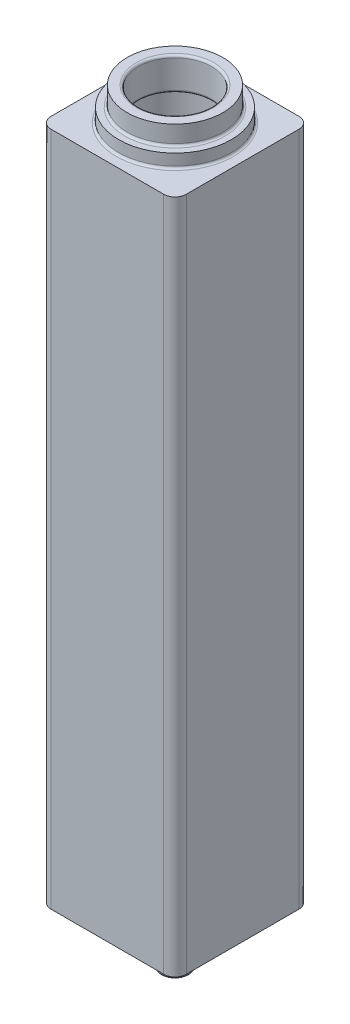
ISO-10303-21;
HEADER;
FILE_DESCRIPTION(('STEP AP214'),'2;1');
FILE_NAME('part.step','',(''),(''),'','','');
FILE_SCHEMA(('AUTOMOTIVE_DESIGN { 1 0 10303 214 1 1 1 1 }'));
ENDSEC;
DATA;
#1=APPLICATION_CONTEXT('core data for automotive mechanical design processes');
#2=APPLICATION_PROTOCOL_DEFINITION('international standard','automotive_design',2000,#1);
#3=PRODUCT_CONTEXT('',#1,'mechanical');
#4=PRODUCT('Part','Part','',(#3));
#5=PRODUCT_RELATED_PRODUCT_CATEGORY('part','',(#4));
#6=PRODUCT_DEFINITION_FORMATION('','',#4);
#7=PRODUCT_DEFINITION_CONTEXT('part definition',#1,'design');
#8=PRODUCT_DEFINITION('design','',#6,#7);
#9=PRODUCT_DEFINITION_SHAPE('','',#8);
#10=(LENGTH_UNIT() NAMED_UNIT(*) SI_UNIT(.MILLI.,.METRE.));
#11=(NAMED_UNIT(*) PLANE_ANGLE_UNIT() SI_UNIT($,.RADIAN.));
#12=(NAMED_UNIT(*) SI_UNIT($,.STERADIAN.) SOLID_ANGLE_UNIT());
#13=UNCERTAINTY_MEASURE_WITH_UNIT(LENGTH_MEASURE(1.E-05),#10,'distance_accuracy_value','');
#14=(GEOMETRIC_REPRESENTATION_CONTEXT(3) GLOBAL_UNCERTAINTY_ASSIGNED_CONTEXT((#13)) GLOBAL_UNIT_ASSIGNED_CONTEXT((#10,
#11,#12)) REPRESENTATION_CONTEXT('',''));
#15=CARTESIAN_POINT('',(0.,0.,0.));
#16=DIRECTION('',(0.,0.,1.));
#17=DIRECTION('',(1.,0.,0.));
#18=AXIS2_PLACEMENT_3D('',#15,#16,#17);
#19=CARTESIAN_POINT('',(0.,10.,0.));
#20=DIRECTION('',(0.,1.,0.));
#21=DIRECTION('',(0.,0.,1.));
#22=AXIS2_PLACEMENT_3D('',#19,#20,#21);
#23=CYLINDRICAL_SURFACE('',#22,35.);
#24=CARTESIAN_POINT('',(0.,10.,0.));
#25=DIRECTION('',(0.,1.,0.));
#26=DIRECTION('',(0.,0.,1.));
#27=AXIS2_PLACEMENT_3D('',#24,#25,#26);
#28=CIRCLE('',#27,35.);
#29=CARTESIAN_POINT('',(0.,10.,35.));
#30=VERTEX_POINT('',#29);
#31=EDGE_CURVE('E315',#30,#30,#28,.T.);
#32=ORIENTED_EDGE('',*,*,#31,.F.);
#33=EDGE_LOOP('',(#32));
#34=FACE_BOUND('',#33,.T.);
#35=CARTESIAN_POINT('',(0.,600.,0.));
#36=DIRECTION('',(0.,1.,0.));
#37=DIRECTION('',(0.,0.,1.));
#38=AXIS2_PLACEMENT_3D('',#35,#36,#37);
#39=CIRCLE('',#38,35.);
#40=CARTESIAN_POINT('',(0.,600.,35.));
#41=VERTEX_POINT('',#40);
#42=EDGE_CURVE('E314',#41,#41,#39,.T.);
#43=ORIENTED_EDGE('',*,*,#42,.T.);
#44=EDGE_LOOP('',(#43));
#45=FACE_BOUND('',#44,.T.);
#46=ADVANCED_FACE('F32',(#34,#45),#23,.F.);
#47=CARTESIAN_POINT('',(0.,10.,0.));
#48=DIRECTION('',(0.,1.,0.));
#49=DIRECTION('',(0.,0.,1.));
#50=AXIS2_PLACEMENT_3D('',#47,#48,#49);
#51=PLANE('',#50);
#52=ORIENTED_EDGE('',*,*,#31,.T.);
#53=EDGE_LOOP('',(#52));
#54=FACE_BOUND('',#53,.T.);
#55=ADVANCED_FACE('F207',(#54),#51,.T.);
#56=CARTESIAN_POINT('',(0.,600.,0.));
#57=DIRECTION('',(0.,1.,0.));
#58=DIRECTION('',(0.,0.,1.));
#59=AXIS2_PLACEMENT_3D('',#56,#57,#58);
#60=PLANE('',#59);
#61=CARTESIAN_POINT('',(0.,600.,0.));
#62=DIRECTION('',(0.,1.,0.));
#63=DIRECTION('',(0.,0.,1.));
#64=AXIS2_PLACEMENT_3D('',#61,#62,#63);
#65=CIRCLE('',#64,34.5);
#66=CARTESIAN_POINT('',(0.,600.,34.5));
#67=VERTEX_POINT('',#66);
#68=EDGE_CURVE('E180',#67,#67,#65,.T.);
#69=ORIENTED_EDGE('',*,*,#68,.T.);
#70=EDGE_LOOP('',(#69));
#71=FACE_BOUND('',#70,.T.);
#72=ORIENTED_EDGE('',*,*,#42,.F.);
#73=EDGE_LOOP('',(#72));
#74=FACE_BOUND('',#73,.T.);
#75=ADVANCED_FACE('F213',(#71,#74),#60,.F.);
#76=CARTESIAN_POINT('',(0.,600.,0.));
#77=DIRECTION('',(0.,1.,0.));
#78=DIRECTION('',(0.,0.,1.));
#79=AXIS2_PLACEMENT_3D('',#76,#77,#78);
#80=CYLINDRICAL_SURFACE('',#79,32.5);
#81=CARTESIAN_POINT('',(0.,627.,0.));
#82=DIRECTION('',(0.,1.,0.));
#83=DIRECTION('',(0.,0.,1.));
#84=AXIS2_PLACEMENT_3D('',#81,#82,#83);
#85=CIRCLE('',#84,32.5);
#86=CARTESIAN_POINT('',(0.,627.,32.5));
#87=VERTEX_POINT('',#86);
#88=EDGE_CURVE('E40',#87,#87,#85,.T.);
#89=ORIENTED_EDGE('',*,*,#88,.T.);
#90=EDGE_LOOP('',(#89));
#91=FACE_BOUND('',#90,.T.);
#92=CARTESIAN_POINT('',(0.,602.,0.));
#93=DIRECTION('',(0.,1.,0.));
#94=DIRECTION('',(0.,0.,1.));
#95=AXIS2_PLACEMENT_3D('',#92,#93,#94);
#96=CIRCLE('',#95,32.5);
#97=CARTESIAN_POINT('',(0.,602.,32.5));
#98=VERTEX_POINT('',#97);
#99=EDGE_CURVE('E183',#98,#98,#96,.F.);
#100=ORIENTED_EDGE('',*,*,#99,.T.);
#101=EDGE_LOOP('',(#100));
#102=FACE_BOUND('',#101,.T.);
#103=ADVANCED_FACE('F194',(#91,#102),#80,.F.);
#104=CARTESIAN_POINT('',(-50.,600.,50.));
#105=DIRECTION('',(0.,1.,0.));
#106=DIRECTION('',(0.,0.,1.));
#107=AXIS2_PLACEMENT_3D('',#104,#105,#106);
#108=CYLINDRICAL_SURFACE('',#107,10.);
#109=DIRECTION('',(0.,1.,0.));
#110=VECTOR('',#109,1.);
#111=CARTESIAN_POINT('',(-60.,600.,50.));
#112=LINE('',#111,#110);
#113=CARTESIAN_POINT('',(-60.,0.,50.));
#114=VERTEX_POINT('',#113);
#115=CARTESIAN_POINT('',(-60.,600.,50.));
#116=VERTEX_POINT('',#115);
#117=EDGE_CURVE('E149',#114,#116,#112,.T.);
#118=ORIENTED_EDGE('',*,*,#117,.F.);
#119=CARTESIAN_POINT('',(-50.,0.,50.));
#120=DIRECTION('',(0.,-1.,0.));
#121=DIRECTION('',(0.,0.,-1.));
#122=AXIS2_PLACEMENT_3D('',#119,#120,#121);
#123=CIRCLE('',#122,10.);
#124=CARTESIAN_POINT('',(-50.,0.,60.));
#125=VERTEX_POINT('',#124);
#126=EDGE_CURVE('E54',#125,#114,#123,.T.);
#127=ORIENTED_EDGE('',*,*,#126,.F.);
#128=DIRECTION('',(0.,1.,0.));
#129=VECTOR('',#128,1.);
#130=CARTESIAN_POINT('',(-50.,600.,60.));
#131=LINE('',#130,#129);
#132=CARTESIAN_POINT('',(-50.,600.,60.));
#133=VERTEX_POINT('',#132);
#134=EDGE_CURVE('E103',#133,#125,#131,.F.);
#135=ORIENTED_EDGE('',*,*,#134,.F.);
#136=CARTESIAN_POINT('',(-50.,600.,50.));
#137=DIRECTION('',(0.,-1.,0.));
#138=DIRECTION('',(0.,0.,-1.));
#139=AXIS2_PLACEMENT_3D('',#136,#137,#138);
#140=CIRCLE('',#139,10.);
#141=EDGE_CURVE('E47',#116,#133,#140,.F.);
#142=ORIENTED_EDGE('',*,*,#141,.F.);
#143=EDGE_LOOP('',(#118,#127,#135,#142));
#144=FACE_BOUND('',#143,.T.);
#145=ADVANCED_FACE('F283',(#144),#108,.T.);
#146=CARTESIAN_POINT('',(-50.,600.,-50.));
#147=DIRECTION('',(0.,1.,0.));
#148=DIRECTION('',(0.,0.,1.));
#149=AXIS2_PLACEMENT_3D('',#146,#147,#148);
#150=CYLINDRICAL_SURFACE('',#149,10.);
#151=DIRECTION('',(0.,1.,0.));
#152=VECTOR('',#151,1.);
#153=CARTESIAN_POINT('',(-50.,600.,-60.));
#154=LINE('',#153,#152);
#155=CARTESIAN_POINT('',(-50.,0.,-60.));
#156=VERTEX_POINT('',#155);
#157=CARTESIAN_POINT('',(-50.,600.,-60.));
#158=VERTEX_POINT('',#157);
#159=EDGE_CURVE('E139',#156,#158,#154,.T.);
#160=ORIENTED_EDGE('',*,*,#159,.F.);
#161=CARTESIAN_POINT('',(-50.,0.,-50.));
#162=DIRECTION('',(0.,-1.,0.));
#163=DIRECTION('',(0.,0.,-1.));
#164=AXIS2_PLACEMENT_3D('',#161,#162,#163);
#165=CIRCLE('',#164,10.);
#166=CARTESIAN_POINT('',(-60.,0.,-50.));
#167=VERTEX_POINT('',#166);
#168=EDGE_CURVE('E145',#167,#156,#165,.T.);
#169=ORIENTED_EDGE('',*,*,#168,.F.);
#170=DIRECTION('',(0.,1.,0.));
#171=VECTOR('',#170,1.);
#172=CARTESIAN_POINT('',(-60.,600.,-50.));
#173=LINE('',#172,#171);
#174=CARTESIAN_POINT('',(-60.,600.,-50.));
#175=VERTEX_POINT('',#174);
#176=EDGE_CURVE('E142',#175,#167,#173,.F.);
#177=ORIENTED_EDGE('',*,*,#176,.F.);
#178=CARTESIAN_POINT('',(-50.,600.,-50.));
#179=DIRECTION('',(0.,-1.,0.));
#180=DIRECTION('',(0.,0.,-1.));
#181=AXIS2_PLACEMENT_3D('',#178,#179,#180);
#182=CIRCLE('',#181,10.);
#183=EDGE_CURVE('E147',#158,#175,#182,.F.);
#184=ORIENTED_EDGE('',*,*,#183,.F.);
#185=EDGE_LOOP('',(#160,#169,#177,#184));
#186=FACE_BOUND('',#185,.T.);
#187=ADVANCED_FACE('F279',(#186),#150,.T.);
#188=CARTESIAN_POINT('',(50.,600.,-50.));
#189=DIRECTION('',(0.,1.,0.));
#190=DIRECTION('',(0.,0.,1.));
#191=AXIS2_PLACEMENT_3D('',#188,#189,#190);
#192=CYLINDRICAL_SURFACE('',#191,10.);
#193=DIRECTION('',(0.,1.,0.));
#194=VECTOR('',#193,1.);
#195=CARTESIAN_POINT('',(60.,600.,-50.));
#196=LINE('',#195,#194);
#197=CARTESIAN_POINT('',(60.,0.,-50.));
#198=VERTEX_POINT('',#197);
#199=CARTESIAN_POINT('',(60.,600.,-50.));
#200=VERTEX_POINT('',#199);
#201=EDGE_CURVE('E129',#198,#200,#196,.T.);
#202=ORIENTED_EDGE('',*,*,#201,.F.);
#203=CARTESIAN_POINT('',(50.,0.,-50.));
#204=DIRECTION('',(0.,-1.,0.));
#205=DIRECTION('',(0.,0.,-1.));
#206=AXIS2_PLACEMENT_3D('',#203,#204,#205);
#207=CIRCLE('',#206,10.);
#208=CARTESIAN_POINT('',(50.,0.,-60.));
#209=VERTEX_POINT('',#208);
#210=EDGE_CURVE('E135',#209,#198,#207,.T.);
#211=ORIENTED_EDGE('',*,*,#210,.F.);
#212=DIRECTION('',(0.,1.,0.));
#213=VECTOR('',#212,1.);
#214=CARTESIAN_POINT('',(50.,600.,-60.));
#215=LINE('',#214,#213);
#216=CARTESIAN_POINT('',(50.,600.,-60.));
#217=VERTEX_POINT('',#216);
#218=EDGE_CURVE('E132',#217,#209,#215,.F.);
#219=ORIENTED_EDGE('',*,*,#218,.F.);
#220=CARTESIAN_POINT('',(50.,600.,-50.));
#221=DIRECTION('',(0.,-1.,0.));
#222=DIRECTION('',(0.,0.,-1.));
#223=AXIS2_PLACEMENT_3D('',#220,#221,#222);
#224=CIRCLE('',#223,10.);
#225=EDGE_CURVE('E137',#200,#217,#224,.F.);
#226=ORIENTED_EDGE('',*,*,#225,.F.);
#227=EDGE_LOOP('',(#202,#211,#219,#226));
#228=FACE_BOUND('',#227,.T.);
#229=ADVANCED_FACE('F276',(#228),#192,.T.);
#230=CARTESIAN_POINT('',(50.,600.,50.));
#231=DIRECTION('',(0.,1.,0.));
#232=DIRECTION('',(0.,0.,1.));
#233=AXIS2_PLACEMENT_3D('',#230,#231,#232);
#234=CYLINDRICAL_SURFACE('',#233,10.);
#235=DIRECTION('',(0.,1.,0.));
#236=VECTOR('',#235,1.);
#237=CARTESIAN_POINT('',(50.,600.,60.));
#238=LINE('',#237,#236);
#239=CARTESIAN_POINT('',(50.,0.,60.));
#240=VERTEX_POINT('',#239);
#241=CARTESIAN_POINT('',(50.,600.,60.));
#242=VERTEX_POINT('',#241);
#243=EDGE_CURVE('E102',#240,#242,#238,.T.);
#244=ORIENTED_EDGE('',*,*,#243,.F.);
#245=CARTESIAN_POINT('',(50.,0.,50.));
#246=DIRECTION('',(0.,-1.,0.));
#247=DIRECTION('',(0.,0.,-1.));
#248=AXIS2_PLACEMENT_3D('',#245,#246,#247);
#249=CIRCLE('',#248,10.);
#250=CARTESIAN_POINT('',(60.,0.,50.));
#251=VERTEX_POINT('',#250);
#252=EDGE_CURVE('E109',#251,#240,#249,.T.);
#253=ORIENTED_EDGE('',*,*,#252,.F.);
#254=DIRECTION('',(0.,1.,0.));
#255=VECTOR('',#254,1.);
#256=CARTESIAN_POINT('',(60.,600.,50.));
#257=LINE('',#256,#255);
#258=CARTESIAN_POINT('',(60.,600.,50.));
#259=VERTEX_POINT('',#258);
#260=EDGE_CURVE('E117',#259,#251,#257,.F.);
#261=ORIENTED_EDGE('',*,*,#260,.F.);
#262=CARTESIAN_POINT('',(50.,600.,50.));
#263=DIRECTION('',(0.,-1.,0.));
#264=DIRECTION('',(0.,0.,-1.));
#265=AXIS2_PLACEMENT_3D('',#262,#263,#264);
#266=CIRCLE('',#265,10.);
#267=EDGE_CURVE('E116',#242,#259,#266,.F.);
#268=ORIENTED_EDGE('',*,*,#267,.F.);
#269=EDGE_LOOP('',(#244,#253,#261,#268));
#270=FACE_BOUND('',#269,.T.);
#271=ADVANCED_FACE('F120',(#270),#234,.T.);
#272=CARTESIAN_POINT('',(60.,600.,60.));
#273=DIRECTION('',(-1.,0.,0.));
#274=DIRECTION('',(0.,0.,1.));
#275=AXIS2_PLACEMENT_3D('',#272,#273,#274);
#276=PLANE('',#275);
#277=DIRECTION('',(0.,0.,-1.));
#278=VECTOR('',#277,1.);
#279=CARTESIAN_POINT('',(60.,0.,60.));
#280=LINE('',#279,#278);
#281=EDGE_CURVE('E112',#251,#198,#280,.T.);
#282=ORIENTED_EDGE('',*,*,#281,.T.);
#283=ORIENTED_EDGE('',*,*,#201,.T.);
#284=DIRECTION('',(0.,0.,-1.));
#285=VECTOR('',#284,1.);
#286=CARTESIAN_POINT('',(60.,600.,60.));
#287=LINE('',#286,#285);
#288=EDGE_CURVE('E105',#259,#200,#287,.T.);
#289=ORIENTED_EDGE('',*,*,#288,.F.);
#290=ORIENTED_EDGE('',*,*,#260,.T.);
#291=EDGE_LOOP('',(#282,#283,#289,#290));
#292=FACE_BOUND('',#291,.T.);
#293=ADVANCED_FACE('F269',(#292),#276,.F.);
#294=CARTESIAN_POINT('',(-60.,600.,-60.));
#295=DIRECTION('',(0.,0.,1.));
#296=DIRECTION('',(1.,0.,0.));
#297=AXIS2_PLACEMENT_3D('',#294,#295,#296);
#298=PLANE('',#297);
#299=DIRECTION('',(-1.,0.,0.));
#300=VECTOR('',#299,1.);
#301=CARTESIAN_POINT('',(-60.,0.,-60.));
#302=LINE('',#301,#300);
#303=EDGE_CURVE('E335',#209,#156,#302,.T.);
#304=ORIENTED_EDGE('',*,*,#303,.T.);
#305=ORIENTED_EDGE('',*,*,#159,.T.);
#306=DIRECTION('',(-1.,0.,0.));
#307=VECTOR('',#306,1.);
#308=CARTESIAN_POINT('',(-60.,600.,-60.));
#309=LINE('',#308,#307);
#310=EDGE_CURVE('E330',#217,#158,#309,.T.);
#311=ORIENTED_EDGE('',*,*,#310,.F.);
#312=ORIENTED_EDGE('',*,*,#218,.T.);
#313=EDGE_LOOP('',(#304,#305,#311,#312));
#314=FACE_BOUND('',#313,.T.);
#315=ADVANCED_FACE('F265',(#314),#298,.F.);
#316=CARTESIAN_POINT('',(-60.,600.,60.));
#317=DIRECTION('',(1.,0.,0.));
#318=DIRECTION('',(0.,0.,-1.));
#319=AXIS2_PLACEMENT_3D('',#316,#317,#318);
#320=PLANE('',#319);
#321=DIRECTION('',(0.,0.,1.));
#322=VECTOR('',#321,1.);
#323=CARTESIAN_POINT('',(-60.,0.,60.));
#324=LINE('',#323,#322);
#325=EDGE_CURVE('E106',#167,#114,#324,.T.);
#326=ORIENTED_EDGE('',*,*,#325,.T.);
#327=ORIENTED_EDGE('',*,*,#117,.T.);
#328=DIRECTION('',(0.,0.,1.));
#329=VECTOR('',#328,1.);
#330=CARTESIAN_POINT('',(-60.,600.,60.));
#331=LINE('',#330,#329);
#332=EDGE_CURVE('E124',#175,#116,#331,.T.);
#333=ORIENTED_EDGE('',*,*,#332,.F.);
#334=ORIENTED_EDGE('',*,*,#176,.T.);
#335=EDGE_LOOP('',(#326,#327,#333,#334));
#336=FACE_BOUND('',#335,.T.);
#337=ADVANCED_FACE('F262',(#336),#320,.F.);
#338=CARTESIAN_POINT('',(-60.,600.,60.));
#339=DIRECTION('',(0.,0.,-1.));
#340=DIRECTION('',(-1.,0.,0.));
#341=AXIS2_PLACEMENT_3D('',#338,#339,#340);
#342=PLANE('',#341);
#343=DIRECTION('',(1.,0.,0.));
#344=VECTOR('',#343,1.);
#345=CARTESIAN_POINT('',(-60.,600.,60.));
#346=LINE('',#345,#344);
#347=EDGE_CURVE('E121',#133,#242,#346,.T.);
#348=ORIENTED_EDGE('',*,*,#347,.F.);
#349=ORIENTED_EDGE('',*,*,#134,.T.);
#350=DIRECTION('',(1.,0.,0.));
#351=VECTOR('',#350,1.);
#352=CARTESIAN_POINT('',(-60.,0.,60.));
#353=LINE('',#352,#351);
#354=EDGE_CURVE('E97',#125,#240,#353,.T.);
#355=ORIENTED_EDGE('',*,*,#354,.T.);
#356=ORIENTED_EDGE('',*,*,#243,.T.);
#357=EDGE_LOOP('',(#348,#349,#355,#356));
#358=FACE_BOUND('',#357,.T.);
#359=ADVANCED_FACE('F100',(#358),#342,.F.);
#360=CARTESIAN_POINT('',(0.,600.,0.));
#361=DIRECTION('',(0.,-1.,0.));
#362=DIRECTION('',(0.,0.,-1.));
#363=AXIS2_PLACEMENT_3D('',#360,#361,#362);
#364=PLANE('',#363);
#365=CARTESIAN_POINT('',(0.,600.,0.));
#366=DIRECTION('',(0.,-1.,0.));
#367=DIRECTION('',(0.,0.,-1.));
#368=AXIS2_PLACEMENT_3D('',#365,#366,#367);
#369=CIRCLE('',#368,52.);
#370=CARTESIAN_POINT('',(0.,600.,-52.));
#371=VERTEX_POINT('',#370);
#372=EDGE_CURVE('E177',#371,#371,#369,.T.);
#373=ORIENTED_EDGE('',*,*,#372,.T.);
#374=EDGE_LOOP('',(#373));
#375=FACE_BOUND('',#374,.T.);
#376=ORIENTED_EDGE('',*,*,#332,.T.);
#377=ORIENTED_EDGE('',*,*,#141,.T.);
#378=ORIENTED_EDGE('',*,*,#347,.T.);
#379=ORIENTED_EDGE('',*,*,#267,.T.);
#380=ORIENTED_EDGE('',*,*,#288,.T.);
#381=ORIENTED_EDGE('',*,*,#225,.T.);
#382=ORIENTED_EDGE('',*,*,#310,.T.);
#383=ORIENTED_EDGE('',*,*,#183,.T.);
#384=EDGE_LOOP('',(#376,#377,#378,#379,#380,#381,#382,#383));
#385=FACE_BOUND('',#384,.T.);
#386=ADVANCED_FACE('F253',(#375,#385),#364,.F.);
#387=CARTESIAN_POINT('',(0.,0.,0.));
#388=DIRECTION('',(0.,-1.,0.));
#389=DIRECTION('',(0.,0.,-1.));
#390=AXIS2_PLACEMENT_3D('',#387,#388,#389);
#391=PLANE('',#390);
#392=CARTESIAN_POINT('',(0.,0.,0.));
#393=DIRECTION('',(0.,-1.,0.));
#394=DIRECTION('',(0.,0.,-1.));
#395=AXIS2_PLACEMENT_3D('',#392,#393,#394);
#396=CIRCLE('',#395,45.);
#397=CARTESIAN_POINT('',(0.,0.,-45.));
#398=VERTEX_POINT('',#397);
#399=EDGE_CURVE('E155',#398,#398,#396,.T.);
#400=ORIENTED_EDGE('',*,*,#399,.F.);
#401=EDGE_LOOP('',(#400));
#402=FACE_BOUND('',#401,.T.);
#403=ORIENTED_EDGE('',*,*,#354,.F.);
#404=ORIENTED_EDGE('',*,*,#126,.T.);
#405=ORIENTED_EDGE('',*,*,#325,.F.);
#406=ORIENTED_EDGE('',*,*,#168,.T.);
#407=ORIENTED_EDGE('',*,*,#303,.F.);
#408=ORIENTED_EDGE('',*,*,#210,.T.);
#409=ORIENTED_EDGE('',*,*,#281,.F.);
#410=ORIENTED_EDGE('',*,*,#252,.T.);
#411=EDGE_LOOP('',(#403,#404,#405,#406,#407,#408,#409,#410));
#412=FACE_BOUND('',#411,.T.);
#413=ADVANCED_FACE('F110',(#402,#412),#391,.T.);
#414=CARTESIAN_POINT('',(0.,612.,0.));
#415=DIRECTION('',(0.,-1.,0.));
#416=DIRECTION('',(0.,0.,-1.));
#417=AXIS2_PLACEMENT_3D('',#414,#415,#416);
#418=CYLINDRICAL_SURFACE('',#417,50.);
#419=CARTESIAN_POINT('',(0.,602.,0.));
#420=DIRECTION('',(0.,-1.,0.));
#421=DIRECTION('',(0.,0.,-1.));
#422=AXIS2_PLACEMENT_3D('',#419,#420,#421);
#423=CIRCLE('',#422,50.);
#424=CARTESIAN_POINT('',(0.,602.,-50.));
#425=VERTEX_POINT('',#424);
#426=EDGE_CURVE('E174',#425,#425,#423,.F.);
#427=ORIENTED_EDGE('',*,*,#426,.T.);
#428=EDGE_LOOP('',(#427));
#429=FACE_BOUND('',#428,.T.);
#430=CARTESIAN_POINT('',(0.,612.,0.));
#431=DIRECTION('',(0.,1.,0.));
#432=DIRECTION('',(0.,0.,1.));
#433=AXIS2_PLACEMENT_3D('',#430,#431,#432);
#434=CIRCLE('',#433,50.);
#435=CARTESIAN_POINT('',(0.,612.,50.));
#436=VERTEX_POINT('',#435);
#437=EDGE_CURVE('E318',#436,#436,#434,.T.);
#438=ORIENTED_EDGE('',*,*,#437,.F.);
#439=EDGE_LOOP('',(#438));
#440=FACE_BOUND('',#439,.T.);
#441=ADVANCED_FACE('F242',(#429,#440),#418,.T.);
#442=CARTESIAN_POINT('',(0.,612.,0.));
#443=DIRECTION('',(0.,1.,0.));
#444=DIRECTION('',(0.,0.,1.));
#445=AXIS2_PLACEMENT_3D('',#442,#443,#444);
#446=PLANE('',#445);
#447=CARTESIAN_POINT('',(0.,612.,0.));
#448=DIRECTION('',(0.,1.,0.));
#449=DIRECTION('',(0.,0.,1.));
#450=AXIS2_PLACEMENT_3D('',#447,#448,#449);
#451=CIRCLE('',#450,44.5);
#452=CARTESIAN_POINT('',(0.,612.,44.5));
#453=VERTEX_POINT('',#452);
#454=EDGE_CURVE('E189',#453,#453,#451,.F.);
#455=ORIENTED_EDGE('',*,*,#454,.T.);
#456=EDGE_LOOP('',(#455));
#457=FACE_BOUND('',#456,.T.);
#458=ORIENTED_EDGE('',*,*,#437,.T.);
#459=EDGE_LOOP('',(#458));
#460=FACE_BOUND('',#459,.T.);
#461=ADVANCED_FACE('F238',(#457,#460),#446,.T.);
#462=CARTESIAN_POINT('',(0.,629.,0.));
#463=DIRECTION('',(0.,1.,0.));
#464=DIRECTION('',(0.,0.,1.));
#465=AXIS2_PLACEMENT_3D('',#462,#463,#464);
#466=PLANE('',#465);
#467=CARTESIAN_POINT('',(0.,629.,0.));
#468=DIRECTION('',(0.,1.,0.));
#469=DIRECTION('',(0.,0.,1.));
#470=AXIS2_PLACEMENT_3D('',#467,#468,#469);
#471=CIRCLE('',#470,34.5);
#472=CARTESIAN_POINT('',(0.,629.,34.5));
#473=VERTEX_POINT('',#472);
#474=EDGE_CURVE('E11',#473,#473,#471,.F.);
#475=ORIENTED_EDGE('',*,*,#474,.T.);
#476=EDGE_LOOP('',(#475));
#477=FACE_BOUND('',#476,.T.);
#478=CARTESIAN_POINT('',(0.,629.,0.));
#479=DIRECTION('',(0.,1.,0.));
#480=DIRECTION('',(0.,0.,1.));
#481=AXIS2_PLACEMENT_3D('',#478,#479,#480);
#482=CIRCLE('',#481,42.5);
#483=CARTESIAN_POINT('',(0.,629.,42.5));
#484=VERTEX_POINT('',#483);
#485=EDGE_CURVE('E325',#484,#484,#482,.T.);
#486=ORIENTED_EDGE('',*,*,#485,.T.);
#487=EDGE_LOOP('',(#486));
#488=FACE_BOUND('',#487,.T.);
#489=ADVANCED_FACE('F241',(#477,#488),#466,.T.);
#490=CARTESIAN_POINT('',(0.,629.,0.));
#491=DIRECTION('',(0.,-1.,0.));
#492=DIRECTION('',(0.,0.,-1.));
#493=AXIS2_PLACEMENT_3D('',#490,#491,#492);
#494=CYLINDRICAL_SURFACE('',#493,42.5);
#495=CARTESIAN_POINT('',(0.,614.,0.));
#496=DIRECTION('',(0.,1.,0.));
#497=DIRECTION('',(0.,0.,1.));
#498=AXIS2_PLACEMENT_3D('',#495,#496,#497);
#499=CIRCLE('',#498,42.5);
#500=CARTESIAN_POINT('',(0.,614.,42.5));
#501=VERTEX_POINT('',#500);
#502=EDGE_CURVE('E186',#501,#501,#499,.T.);
#503=ORIENTED_EDGE('',*,*,#502,.T.);
#504=EDGE_LOOP('',(#503));
#505=FACE_BOUND('',#504,.T.);
#506=ORIENTED_EDGE('',*,*,#485,.F.);
#507=EDGE_LOOP('',(#506));
#508=FACE_BOUND('',#507,.T.);
#509=ADVANCED_FACE('F236',(#505,#508),#494,.T.);
#510=CARTESIAN_POINT('',(0.,-12.,0.));
#511=DIRECTION('',(0.,1.,0.));
#512=DIRECTION('',(0.,0.,1.));
#513=AXIS2_PLACEMENT_3D('',#510,#511,#512);
#514=CYLINDRICAL_SURFACE('',#513,45.);
#515=CARTESIAN_POINT('',(0.,-10.,0.));
#516=DIRECTION('',(0.,-1.,0.));
#517=DIRECTION('',(0.,0.,-1.));
#518=AXIS2_PLACEMENT_3D('',#515,#516,#517);
#519=CIRCLE('',#518,45.);
#520=CARTESIAN_POINT('',(0.,-10.,-45.));
#521=VERTEX_POINT('',#520);
#522=EDGE_CURVE('E162',#521,#521,#519,.F.);
#523=ORIENTED_EDGE('',*,*,#522,.T.);
#524=EDGE_LOOP('',(#523));
#525=FACE_BOUND('',#524,.T.);
#526=ORIENTED_EDGE('',*,*,#399,.T.);
#527=EDGE_LOOP('',(#526));
#528=FACE_BOUND('',#527,.T.);
#529=ADVANCED_FACE('F232',(#525,#528),#514,.T.);
#530=CARTESIAN_POINT('',(0.,-12.,0.));
#531=DIRECTION('',(0.,-1.,0.));
#532=DIRECTION('',(0.,0.,-1.));
#533=AXIS2_PLACEMENT_3D('',#530,#531,#532);
#534=PLANE('',#533);
#535=CARTESIAN_POINT('',(0.,-12.,0.));
#536=DIRECTION('',(0.,-1.,0.));
#537=DIRECTION('',(0.,0.,-1.));
#538=AXIS2_PLACEMENT_3D('',#535,#536,#537);
#539=CIRCLE('',#538,43.);
#540=CARTESIAN_POINT('',(0.,-12.,-43.));
#541=VERTEX_POINT('',#540);
#542=EDGE_CURVE('E159',#541,#541,#539,.T.);
#543=ORIENTED_EDGE('',*,*,#542,.T.);
#544=EDGE_LOOP('',(#543));
#545=FACE_BOUND('',#544,.T.);
#546=CARTESIAN_POINT('',(0.,-12.,0.));
#547=DIRECTION('',(0.,-1.,0.));
#548=DIRECTION('',(0.,0.,-1.));
#549=AXIS2_PLACEMENT_3D('',#546,#547,#548);
#550=CIRCLE('',#549,14.5);
#551=CARTESIAN_POINT('',(0.,-12.,-14.5));
#552=VERTEX_POINT('',#551);
#553=EDGE_CURVE('E156',#552,#552,#550,.F.);
#554=ORIENTED_EDGE('',*,*,#553,.T.);
#555=EDGE_LOOP('',(#554));
#556=FACE_BOUND('',#555,.T.);
#557=ADVANCED_FACE('F228',(#545,#556),#534,.T.);
#558=CARTESIAN_POINT('',(0.,-50.,0.));
#559=DIRECTION('',(0.,1.,0.));
#560=DIRECTION('',(0.,0.,1.));
#561=AXIS2_PLACEMENT_3D('',#558,#559,#560);
#562=CYLINDRICAL_SURFACE('',#561,12.5);
#563=CARTESIAN_POINT('',(0.,-48.,0.));
#564=DIRECTION('',(0.,-1.,0.));
#565=DIRECTION('',(0.,0.,-1.));
#566=AXIS2_PLACEMENT_3D('',#563,#564,#565);
#567=CIRCLE('',#566,12.5);
#568=CARTESIAN_POINT('',(0.,-48.,-12.5));
#569=VERTEX_POINT('',#568);
#570=EDGE_CURVE('E171',#569,#569,#567,.F.);
#571=ORIENTED_EDGE('',*,*,#570,.T.);
#572=EDGE_LOOP('',(#571));
#573=FACE_BOUND('',#572,.T.);
#574=CARTESIAN_POINT('',(0.,-14.,0.));
#575=DIRECTION('',(0.,-1.,0.));
#576=DIRECTION('',(0.,0.,-1.));
#577=AXIS2_PLACEMENT_3D('',#574,#575,#576);
#578=CIRCLE('',#577,12.5);
#579=CARTESIAN_POINT('',(0.,-14.,-12.5));
#580=VERTEX_POINT('',#579);
#581=EDGE_CURVE('E165',#580,#580,#578,.T.);
#582=ORIENTED_EDGE('',*,*,#581,.T.);
#583=EDGE_LOOP('',(#582));
#584=FACE_BOUND('',#583,.T.);
#585=ADVANCED_FACE('F224',(#573,#584),#562,.T.);
#586=CARTESIAN_POINT('',(0.,-50.,0.));
#587=DIRECTION('',(0.,-1.,0.));
#588=DIRECTION('',(0.,0.,-1.));
#589=AXIS2_PLACEMENT_3D('',#586,#587,#588);
#590=PLANE('',#589);
#591=CARTESIAN_POINT('',(0.,-50.,0.));
#592=DIRECTION('',(0.,-1.,0.));
#593=DIRECTION('',(0.,0.,-1.));
#594=AXIS2_PLACEMENT_3D('',#591,#592,#593);
#595=CIRCLE('',#594,10.5);
#596=CARTESIAN_POINT('',(0.,-50.,-10.5));
#597=VERTEX_POINT('',#596);
#598=EDGE_CURVE('E168',#597,#597,#595,.T.);
#599=ORIENTED_EDGE('',*,*,#598,.T.);
#600=EDGE_LOOP('',(#599));
#601=FACE_BOUND('',#600,.T.);
#602=ADVANCED_FACE('F220',(#601),#590,.T.);
#603=CARTESIAN_POINT('',(0.,-10.,0.));
#604=DIRECTION('',(0.,-1.,0.));
#605=DIRECTION('',(0.,0.,-1.));
#606=AXIS2_PLACEMENT_3D('',#603,#604,#605);
#607=TOROIDAL_SURFACE('',#606,43.,2.);
#608=ORIENTED_EDGE('',*,*,#522,.F.);
#609=EDGE_LOOP('',(#608));
#610=FACE_BOUND('',#609,.T.);
#611=ORIENTED_EDGE('',*,*,#542,.F.);
#612=EDGE_LOOP('',(#611));
#613=FACE_BOUND('',#612,.T.);
#614=ADVANCED_FACE('F223',(#610,#613),#607,.T.);
#615=CARTESIAN_POINT('',(0.,-14.,0.));
#616=DIRECTION('',(0.,-1.,0.));
#617=DIRECTION('',(0.,0.,-1.));
#618=AXIS2_PLACEMENT_3D('',#615,#616,#617);
#619=TOROIDAL_SURFACE('',#618,14.5,2.);
#620=ORIENTED_EDGE('',*,*,#581,.F.);
#621=EDGE_LOOP('',(#620));
#622=FACE_BOUND('',#621,.T.);
#623=ORIENTED_EDGE('',*,*,#553,.F.);
#624=EDGE_LOOP('',(#623));
#625=FACE_BOUND('',#624,.T.);
#626=ADVANCED_FACE('F289',(#622,#625),#619,.F.);
#627=CARTESIAN_POINT('',(0.,-48.,0.));
#628=DIRECTION('',(0.,-1.,0.));
#629=DIRECTION('',(0.,0.,-1.));
#630=AXIS2_PLACEMENT_3D('',#627,#628,#629);
#631=TOROIDAL_SURFACE('',#630,10.5,2.);
#632=ORIENTED_EDGE('',*,*,#570,.F.);
#633=EDGE_LOOP('',(#632));
#634=FACE_BOUND('',#633,.T.);
#635=ORIENTED_EDGE('',*,*,#598,.F.);
#636=EDGE_LOOP('',(#635));
#637=FACE_BOUND('',#636,.T.);
#638=ADVANCED_FACE('F293',(#634,#637),#631,.T.);
#639=CARTESIAN_POINT('',(0.,602.,0.));
#640=DIRECTION('',(0.,-1.,0.));
#641=DIRECTION('',(0.,0.,-1.));
#642=AXIS2_PLACEMENT_3D('',#639,#640,#641);
#643=TOROIDAL_SURFACE('',#642,52.,2.);
#644=ORIENTED_EDGE('',*,*,#372,.F.);
#645=EDGE_LOOP('',(#644));
#646=FACE_BOUND('',#645,.T.);
#647=ORIENTED_EDGE('',*,*,#426,.F.);
#648=EDGE_LOOP('',(#647));
#649=FACE_BOUND('',#648,.T.);
#650=ADVANCED_FACE('F297',(#646,#649),#643,.F.);
#651=CARTESIAN_POINT('',(0.,602.,0.));
#652=DIRECTION('',(0.,1.,0.));
#653=DIRECTION('',(0.,0.,1.));
#654=AXIS2_PLACEMENT_3D('',#651,#652,#653);
#655=TOROIDAL_SURFACE('',#654,34.5,2.);
#656=ORIENTED_EDGE('',*,*,#99,.F.);
#657=EDGE_LOOP('',(#656));
#658=FACE_BOUND('',#657,.T.);
#659=ORIENTED_EDGE('',*,*,#68,.F.);
#660=EDGE_LOOP('',(#659));
#661=FACE_BOUND('',#660,.T.);
#662=ADVANCED_FACE('F203',(#658,#661),#655,.T.);
#663=CARTESIAN_POINT('',(0.,614.,0.));
#664=DIRECTION('',(0.,1.,0.));
#665=DIRECTION('',(0.,0.,1.));
#666=AXIS2_PLACEMENT_3D('',#663,#664,#665);
#667=TOROIDAL_SURFACE('',#666,44.5,2.);
#668=ORIENTED_EDGE('',*,*,#454,.F.);
#669=EDGE_LOOP('',(#668));
#670=FACE_BOUND('',#669,.T.);
#671=ORIENTED_EDGE('',*,*,#502,.F.);
#672=EDGE_LOOP('',(#671));
#673=FACE_BOUND('',#672,.T.);
#674=ADVANCED_FACE('F198',(#670,#673),#667,.F.);
#675=CARTESIAN_POINT('',(0.,627.,0.));
#676=DIRECTION('',(0.,1.,0.));
#677=DIRECTION('',(0.,0.,1.));
#678=AXIS2_PLACEMENT_3D('',#675,#676,#677);
#679=TOROIDAL_SURFACE('',#678,34.5,2.);
#680=ORIENTED_EDGE('',*,*,#474,.F.);
#681=EDGE_LOOP('',(#680));
#682=FACE_BOUND('',#681,.T.);
#683=ORIENTED_EDGE('',*,*,#88,.F.);
#684=EDGE_LOOP('',(#683));
#685=FACE_BOUND('',#684,.T.);
#686=ADVANCED_FACE('F34',(#682,#685),#679,.T.);
#687=CLOSED_SHELL('',(#46,#55,#75,#103,#145,#187,#229,#271,#293,#315,#337,#359,#386,#413,#441,
#461,#489,#509,#529,#557,#585,#602,#614,#626,#638,#650,#662,#674,#686));
#688=MANIFOLD_SOLID_BREP('B2',#687);
#689=ADVANCED_BREP_SHAPE_REPRESENTATION('',(#18,#688),#14);
#690=SHAPE_DEFINITION_REPRESENTATION(#9,#689);
ENDSEC;
END-ISO-10303-21;
